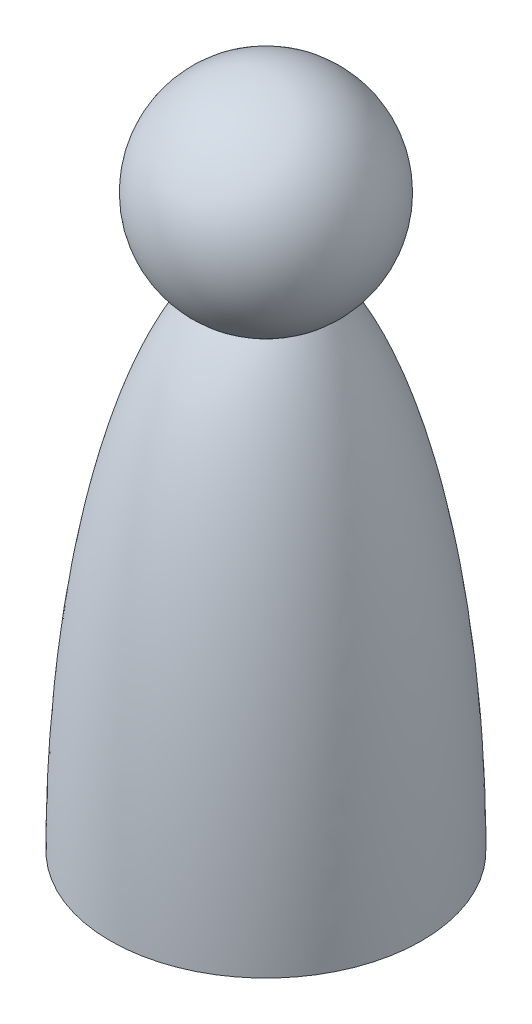
ISO-10303-21;
HEADER;
FILE_DESCRIPTION(('STEP AP214'),'2;1');
FILE_NAME('part.step','',(''),(''),'','','');
FILE_SCHEMA(('AUTOMOTIVE_DESIGN { 1 0 10303 214 1 1 1 1 }'));
ENDSEC;
DATA;
#1=APPLICATION_CONTEXT('core data for automotive mechanical design processes');
#2=APPLICATION_PROTOCOL_DEFINITION('international standard','automotive_design',2000,#1);
#3=PRODUCT_CONTEXT('',#1,'mechanical');
#4=PRODUCT('Part','Part','',(#3));
#5=PRODUCT_RELATED_PRODUCT_CATEGORY('part','',(#4));
#6=PRODUCT_DEFINITION_FORMATION('','',#4);
#7=PRODUCT_DEFINITION_CONTEXT('part definition',#1,'design');
#8=PRODUCT_DEFINITION('design','',#6,#7);
#9=PRODUCT_DEFINITION_SHAPE('','',#8);
#10=(LENGTH_UNIT() NAMED_UNIT(*) SI_UNIT(.MILLI.,.METRE.));
#11=(NAMED_UNIT(*) PLANE_ANGLE_UNIT() SI_UNIT($,.RADIAN.));
#12=(NAMED_UNIT(*) SI_UNIT($,.STERADIAN.) SOLID_ANGLE_UNIT());
#13=UNCERTAINTY_MEASURE_WITH_UNIT(LENGTH_MEASURE(1.E-05),#10,'distance_accuracy_value','');
#14=(GEOMETRIC_REPRESENTATION_CONTEXT(3) GLOBAL_UNCERTAINTY_ASSIGNED_CONTEXT((#13)) GLOBAL_UNIT_ASSIGNED_CONTEXT((#10,
#11,#12)) REPRESENTATION_CONTEXT('',''));
#15=CARTESIAN_POINT('',(0.,0.,0.));
#16=DIRECTION('',(0.,0.,1.));
#17=DIRECTION('',(1.,0.,0.));
#18=AXIS2_PLACEMENT_3D('',#15,#16,#17);
#19=CARTESIAN_POINT('',(0.,0.,0.));
#20=DIRECTION('',(0.,0.,1.));
#21=DIRECTION('',(0.,-1.,0.));
#22=AXIS2_PLACEMENT_3D('',#19,#20,#21);
#23=ELLIPSE('',#22,63.5,19.05);
#24=TRIMMED_CURVE('',#23,(PARAMETER_VALUE(3.14159265358979)),
(PARAMETER_VALUE(6.28318530717959)),.T.,.PARAMETER.);
#25=CARTESIAN_POINT('',(0.,0.,0.));
#26=DIRECTION('',(0.,1.,0.));
#27=AXIS1_PLACEMENT('',#25,#26);
#28=SURFACE_OF_REVOLUTION('',#24,#27);
#29=CARTESIAN_POINT('',(0.,0.,0.));
#30=DIRECTION('',(0.,1.,0.));
#31=DIRECTION('',(-1.,0.,0.));
#32=AXIS2_PLACEMENT_3D('',#29,#30,#31);
#33=CIRCLE('',#32,19.05);
#34=CARTESIAN_POINT('',(-19.05,0.,0.));
#35=VERTEX_POINT('',#34);
#36=EDGE_CURVE('E10',#35,#35,#33,.T.);
#37=ORIENTED_EDGE('',*,*,#36,.T.);
#38=EDGE_LOOP('',(#37));
#39=FACE_BOUND('',#38,.T.);
#40=CARTESIAN_POINT('',(0.,59.1880313667445,0.));
#41=DIRECTION('',(0.,1.,0.));
#42=DIRECTION('',(-1.,0.,0.));
#43=AXIS2_PLACEMENT_3D('',#40,#41,#42);
#44=CIRCLE('',#43,6.90017571251952);
#45=CARTESIAN_POINT('',(-6.9001757125195,59.1880313667445,0.));
#46=VERTEX_POINT('',#45);
#47=EDGE_CURVE('E47',#46,#46,#44,.T.);
#48=ORIENTED_EDGE('',*,*,#47,.F.);
#49=EDGE_LOOP('',(#48));
#50=FACE_BOUND('',#49,.T.);
#51=ADVANCED_FACE('F32',(#39,#50),#28,.F.);
#52=CARTESIAN_POINT('',(-19.05,0.,0.));
#53=DIRECTION('',(0.,-1.,0.));
#54=DIRECTION('',(1.,0.,0.));
#55=AXIS2_PLACEMENT_3D('',#52,#53,#54);
#56=PLANE('',#55);
#57=CARTESIAN_POINT('',(0.,0.,0.));
#58=DIRECTION('',(0.,1.,0.));
#59=DIRECTION('',(-1.,0.,0.));
#60=AXIS2_PLACEMENT_3D('',#57,#58,#59);
#61=CIRCLE('',#60,12.7);
#62=CARTESIAN_POINT('',(-12.7,0.,0.));
#63=VERTEX_POINT('',#62);
#64=EDGE_CURVE('E39',#63,#63,#61,.T.);
#65=ORIENTED_EDGE('',*,*,#64,.T.);
#66=EDGE_LOOP('',(#65));
#67=FACE_BOUND('',#66,.T.);
#68=ORIENTED_EDGE('',*,*,#36,.F.);
#69=EDGE_LOOP('',(#68));
#70=FACE_BOUND('',#69,.T.);
#71=ADVANCED_FACE('F57',(#67,#70),#56,.T.);
#72=CARTESIAN_POINT('',(0.,0.,0.));
#73=DIRECTION('',(0.,1.,0.));
#74=DIRECTION('',(-1.,0.,0.));
#75=AXIS2_PLACEMENT_3D('',#72,#73,#74);
#76=CYLINDRICAL_SURFACE('',#75,12.7);
#77=CARTESIAN_POINT('',(0.,-3.683,0.));
#78=DIRECTION('',(0.,1.,0.));
#79=DIRECTION('',(-1.,0.,0.));
#80=AXIS2_PLACEMENT_3D('',#77,#78,#79);
#81=CIRCLE('',#80,12.7);
#82=CARTESIAN_POINT('',(-12.7,-3.683,0.));
#83=VERTEX_POINT('',#82);
#84=EDGE_CURVE('E43',#83,#83,#81,.T.);
#85=ORIENTED_EDGE('',*,*,#84,.T.);
#86=EDGE_LOOP('',(#85));
#87=FACE_BOUND('',#86,.T.);
#88=ORIENTED_EDGE('',*,*,#64,.F.);
#89=EDGE_LOOP('',(#88));
#90=FACE_BOUND('',#89,.T.);
#91=ADVANCED_FACE('F61',(#87,#90),#76,.T.);
#92=CARTESIAN_POINT('',(0.,-3.683,0.));
#93=DIRECTION('',(0.,-1.,0.));
#94=DIRECTION('',(1.,0.,0.));
#95=AXIS2_PLACEMENT_3D('',#92,#93,#94);
#96=PLANE('',#95);
#97=ORIENTED_EDGE('',*,*,#84,.F.);
#98=EDGE_LOOP('',(#97));
#99=FACE_BOUND('',#98,.T.);
#100=ADVANCED_FACE('F65',(#99),#96,.T.);
#101=CARTESIAN_POINT('',(0.,69.85,0.));
#102=DIRECTION('',(0.,1.,0.));
#103=DIRECTION('',(-1.,0.,0.));
#104=AXIS2_PLACEMENT_3D('',#101,#102,#103);
#105=SPHERICAL_SURFACE('',#104,12.7000000000066);
#106=ORIENTED_EDGE('',*,*,#47,.T.);
#107=EDGE_LOOP('',(#106));
#108=FACE_BOUND('',#107,.T.);
#109=ADVANCED_FACE('F54',(#108),#105,.T.);
#110=CLOSED_SHELL('',(#51,#71,#91,#100,#109));
#111=MANIFOLD_SOLID_BREP('B2',#110);
#112=ADVANCED_BREP_SHAPE_REPRESENTATION('',(#18,#111),#14);
#113=SHAPE_DEFINITION_REPRESENTATION(#9,#112);
ENDSEC;
END-ISO-10303-21;
